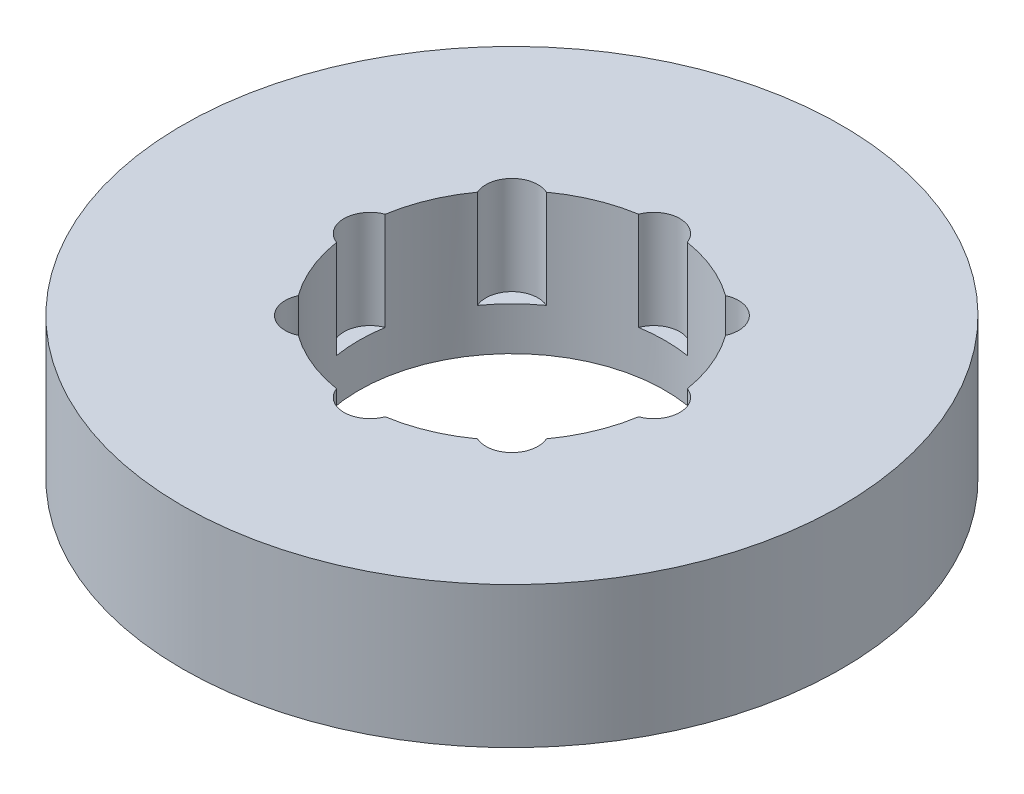
ISO-10303-21;
HEADER;
FILE_DESCRIPTION(('STEP AP214'),'2;1');
FILE_NAME('part.step','',(''),(''),'','','');
FILE_SCHEMA(('AUTOMOTIVE_DESIGN { 1 0 10303 214 1 1 1 1 }'));
ENDSEC;
DATA;
#1=APPLICATION_CONTEXT('core data for automotive mechanical design processes');
#2=APPLICATION_PROTOCOL_DEFINITION('international standard','automotive_design',2000,#1);
#3=PRODUCT_CONTEXT('',#1,'mechanical');
#4=PRODUCT('Part','Part','',(#3));
#5=PRODUCT_RELATED_PRODUCT_CATEGORY('part','',(#4));
#6=PRODUCT_DEFINITION_FORMATION('','',#4);
#7=PRODUCT_DEFINITION_CONTEXT('part definition',#1,'design');
#8=PRODUCT_DEFINITION('design','',#6,#7);
#9=PRODUCT_DEFINITION_SHAPE('','',#8);
#10=(LENGTH_UNIT() NAMED_UNIT(*) SI_UNIT(.MILLI.,.METRE.));
#11=(NAMED_UNIT(*) PLANE_ANGLE_UNIT() SI_UNIT($,.RADIAN.));
#12=(NAMED_UNIT(*) SI_UNIT($,.STERADIAN.) SOLID_ANGLE_UNIT());
#13=UNCERTAINTY_MEASURE_WITH_UNIT(LENGTH_MEASURE(1.E-05),#10,'distance_accuracy_value','');
#14=(GEOMETRIC_REPRESENTATION_CONTEXT(3) GLOBAL_UNCERTAINTY_ASSIGNED_CONTEXT((#13)) GLOBAL_UNIT_ASSIGNED_CONTEXT((#10,
#11,#12)) REPRESENTATION_CONTEXT('',''));
#15=CARTESIAN_POINT('',(0.,0.,0.));
#16=DIRECTION('',(0.,0.,1.));
#17=DIRECTION('',(1.,0.,0.));
#18=AXIS2_PLACEMENT_3D('',#15,#16,#17);
#19=CARTESIAN_POINT('',(0.,30.,0.));
#20=DIRECTION('',(0.,-1.,0.));
#21=DIRECTION('',(0.,0.,-1.));
#22=AXIS2_PLACEMENT_3D('',#19,#20,#21);
#23=CYLINDRICAL_SURFACE('',#22,70.);
#24=CARTESIAN_POINT('',(0.,30.,0.));
#25=DIRECTION('',(0.,1.,0.));
#26=DIRECTION('',(0.,0.,1.));
#27=AXIS2_PLACEMENT_3D('',#24,#25,#26);
#28=CIRCLE('',#27,70.);
#29=CARTESIAN_POINT('',(0.,30.,70.));
#30=VERTEX_POINT('',#29);
#31=EDGE_CURVE('E183',#30,#30,#28,.T.);
#32=ORIENTED_EDGE('',*,*,#31,.F.);
#33=EDGE_LOOP('',(#32));
#34=FACE_BOUND('',#33,.T.);
#35=CARTESIAN_POINT('',(0.,0.,0.));
#36=DIRECTION('',(0.,1.,0.));
#37=DIRECTION('',(0.,0.,1.));
#38=AXIS2_PLACEMENT_3D('',#35,#36,#37);
#39=CIRCLE('',#38,70.);
#40=CARTESIAN_POINT('',(0.,0.,70.));
#41=VERTEX_POINT('',#40);
#42=EDGE_CURVE('E182',#41,#41,#39,.T.);
#43=ORIENTED_EDGE('',*,*,#42,.T.);
#44=EDGE_LOOP('',(#43));
#45=FACE_BOUND('',#44,.T.);
#46=ADVANCED_FACE('F39',(#34,#45),#23,.T.);
#47=CARTESIAN_POINT('',(0.,30.,0.));
#48=DIRECTION('',(0.,1.,0.));
#49=DIRECTION('',(0.,0.,1.));
#50=AXIS2_PLACEMENT_3D('',#47,#48,#49);
#51=PLANE('',#50);
#52=CARTESIAN_POINT('',(1.05216337679654E-13,30.,30.1351568198605));
#53=DIRECTION('',(0.,1.,0.));
#54=DIRECTION('',(1.,0.,0.));
#55=AXIS2_PLACEMENT_3D('',#52,#53,#54);
#56=CIRCLE('',#55,5.52938833569611);
#57=CARTESIAN_POINT('',(-5.17399955720129,30.,32.0855065190201));
#58=VERTEX_POINT('',#57);
#59=CARTESIAN_POINT('',(5.17399955720152,30.,32.0855065190201));
#60=VERTEX_POINT('',#59);
#61=EDGE_CURVE('E256',#58,#60,#56,.T.);
#62=ORIENTED_EDGE('',*,*,#61,.F.);
#63=CARTESIAN_POINT('',(0.,30.,0.));
#64=DIRECTION('',(0.,1.,0.));
#65=DIRECTION('',(0.,0.,1.));
#66=AXIS2_PLACEMENT_3D('',#63,#64,#65);
#67=CIRCLE('',#66,32.5);
#68=CARTESIAN_POINT('',(-19.0293090646509,30.,26.3464494101576));
#69=VERTEX_POINT('',#68);
#70=EDGE_CURVE('E175',#69,#58,#67,.T.);
#71=ORIENTED_EDGE('',*,*,#70,.F.);
#72=CARTESIAN_POINT('',(-21.3087737394434,30.,21.3087737394434));
#73=DIRECTION('',(0.,1.,0.));
#74=DIRECTION('',(0.707106781186549,0.,0.707106781186546));
#75=AXIS2_PLACEMENT_3D('',#72,#73,#74);
#76=CIRCLE('',#75,5.52938833569611);
#77=CARTESIAN_POINT('',(-26.3464494101575,30.,19.029309064651));
#78=VERTEX_POINT('',#77);
#79=EDGE_CURVE('E152',#78,#69,#76,.T.);
#80=ORIENTED_EDGE('',*,*,#79,.F.);
#81=CARTESIAN_POINT('',(-32.0855065190201,30.,5.17399955720141));
#82=VERTEX_POINT('',#81);
#83=EDGE_CURVE('E168',#82,#78,#67,.T.);
#84=ORIENTED_EDGE('',*,*,#83,.F.);
#85=CARTESIAN_POINT('',(-30.1351568198605,30.,0.));
#86=DIRECTION('',(0.,1.,0.));
#87=DIRECTION('',(0.,0.,1.));
#88=AXIS2_PLACEMENT_3D('',#85,#86,#87);
#89=CIRCLE('',#88,5.52938833569611);
#90=CARTESIAN_POINT('',(-32.0855065190201,30.,-5.17399955720141));
#91=VERTEX_POINT('',#90);
#92=EDGE_CURVE('E205',#91,#82,#89,.T.);
#93=ORIENTED_EDGE('',*,*,#92,.F.);
#94=CARTESIAN_POINT('',(-26.3464494101578,30.,-19.0293090646506));
#95=VERTEX_POINT('',#94);
#96=EDGE_CURVE('E181',#95,#91,#67,.T.);
#97=ORIENTED_EDGE('',*,*,#96,.F.);
#98=CARTESIAN_POINT('',(-21.3087737394437,30.,-21.3087737394431));
#99=DIRECTION('',(0.,1.,0.));
#100=DIRECTION('',(-0.707106781186539,0.,0.707106781186556));
#101=AXIS2_PLACEMENT_3D('',#98,#99,#100);
#102=CIRCLE('',#101,5.52938833569611);
#103=CARTESIAN_POINT('',(-19.0293090646513,30.,-26.3464494101574));
#104=VERTEX_POINT('',#103);
#105=EDGE_CURVE('E453',#104,#95,#102,.T.);
#106=ORIENTED_EDGE('',*,*,#105,.F.);
#107=CARTESIAN_POINT('',(-5.17399955720174,30.,-32.08550651902));
#108=VERTEX_POINT('',#107);
#109=EDGE_CURVE('E189',#108,#104,#67,.T.);
#110=ORIENTED_EDGE('',*,*,#109,.F.);
#111=CARTESIAN_POINT('',(-3.15649013038963E-13,30.,-30.1351568198605));
#112=DIRECTION('',(0.,1.,0.));
#113=DIRECTION('',(-1.,0.,0.));
#114=AXIS2_PLACEMENT_3D('',#111,#112,#113);
#115=CIRCLE('',#114,5.52938833569611);
#116=CARTESIAN_POINT('',(5.17399955720107,30.,-32.0855065190201));
#117=VERTEX_POINT('',#116);
#118=EDGE_CURVE('E462',#117,#108,#115,.T.);
#119=ORIENTED_EDGE('',*,*,#118,.F.);
#120=CARTESIAN_POINT('',(19.0293090646507,30.,-26.3464494101577));
#121=VERTEX_POINT('',#120);
#122=EDGE_CURVE('E197',#121,#117,#67,.T.);
#123=ORIENTED_EDGE('',*,*,#122,.F.);
#124=CARTESIAN_POINT('',(21.3087737394432,30.,-21.3087737394436));
#125=DIRECTION('',(0.,1.,0.));
#126=DIRECTION('',(-0.707106781186554,0.,-0.707106781186541));
#127=AXIS2_PLACEMENT_3D('',#124,#125,#126);
#128=CIRCLE('',#127,5.52938833569611);
#129=CARTESIAN_POINT('',(26.3464494101574,30.,-19.0293090646512));
#130=VERTEX_POINT('',#129);
#131=EDGE_CURVE('E470',#130,#121,#128,.T.);
#132=ORIENTED_EDGE('',*,*,#131,.F.);
#133=CARTESIAN_POINT('',(32.0855065190201,30.,-5.17399955720141));
#134=VERTEX_POINT('',#133);
#135=EDGE_CURVE('E489',#134,#130,#67,.T.);
#136=ORIENTED_EDGE('',*,*,#135,.F.);
#137=CARTESIAN_POINT('',(30.1351568198605,30.,0.));
#138=DIRECTION('',(0.,1.,0.));
#139=DIRECTION('',(0.,0.,-1.));
#140=AXIS2_PLACEMENT_3D('',#137,#138,#139);
#141=CIRCLE('',#140,5.52938833569611);
#142=CARTESIAN_POINT('',(32.0855065190201,30.,5.17399955720141));
#143=VERTEX_POINT('',#142);
#144=EDGE_CURVE('E476',#143,#134,#141,.T.);
#145=ORIENTED_EDGE('',*,*,#144,.F.);
#146=CARTESIAN_POINT('',(26.3464494101577,30.,19.0293090646508));
#147=VERTEX_POINT('',#146);
#148=EDGE_CURVE('E491',#147,#143,#67,.T.);
#149=ORIENTED_EDGE('',*,*,#148,.F.);
#150=CARTESIAN_POINT('',(21.3087737394435,30.,21.3087737394433));
#151=DIRECTION('',(0.,1.,0.));
#152=DIRECTION('',(0.707106781186544,0.,-0.707106781186551));
#153=AXIS2_PLACEMENT_3D('',#150,#151,#152);
#154=CIRCLE('',#153,5.52938833569611);
#155=CARTESIAN_POINT('',(19.0293090646511,30.,26.3464494101575));
#156=VERTEX_POINT('',#155);
#157=EDGE_CURVE('E475',#156,#147,#154,.T.);
#158=ORIENTED_EDGE('',*,*,#157,.F.);
#159=EDGE_CURVE('E190',#60,#156,#67,.T.);
#160=ORIENTED_EDGE('',*,*,#159,.F.);
#161=EDGE_LOOP('',(#62,#71,#80,#84,#93,#97,#106,#110,#119,#123,#132,#136,#145,#149,#158,#160));
#162=FACE_BOUND('',#161,.T.);
#163=ORIENTED_EDGE('',*,*,#31,.T.);
#164=EDGE_LOOP('',(#163));
#165=FACE_BOUND('',#164,.T.);
#166=ADVANCED_FACE('F170',(#162,#165),#51,.T.);
#167=CARTESIAN_POINT('',(0.,0.,0.));
#168=DIRECTION('',(0.,1.,0.));
#169=DIRECTION('',(0.,0.,1.));
#170=AXIS2_PLACEMENT_3D('',#167,#168,#169);
#171=PLANE('',#170);
#172=CARTESIAN_POINT('',(0.,0.,0.));
#173=DIRECTION('',(0.,1.,0.));
#174=DIRECTION('',(0.,0.,1.));
#175=AXIS2_PLACEMENT_3D('',#172,#173,#174);
#176=CIRCLE('',#175,32.5);
#177=CARTESIAN_POINT('',(0.,0.,32.5));
#178=VERTEX_POINT('',#177);
#179=EDGE_CURVE('E191',#178,#178,#176,.T.);
#180=ORIENTED_EDGE('',*,*,#179,.T.);
#181=EDGE_LOOP('',(#180));
#182=FACE_BOUND('',#181,.T.);
#183=ORIENTED_EDGE('',*,*,#42,.F.);
#184=EDGE_LOOP('',(#183));
#185=FACE_BOUND('',#184,.T.);
#186=ADVANCED_FACE('F277',(#182,#185),#171,.F.);
#187=CARTESIAN_POINT('',(0.,30.,0.));
#188=DIRECTION('',(0.,-1.,0.));
#189=DIRECTION('',(0.,0.,-1.));
#190=AXIS2_PLACEMENT_3D('',#187,#188,#189);
#191=CYLINDRICAL_SURFACE('',#190,32.5);
#192=DIRECTION('',(0.,1.,0.));
#193=VECTOR('',#192,1.);
#194=CARTESIAN_POINT('',(-5.17399955720129,19.585064636626,32.0855065190201));
#195=LINE('',#194,#193);
#196=CARTESIAN_POINT('',(-5.17399955720129,9.17012927325192,32.0855065190201));
#197=VERTEX_POINT('',#196);
#198=EDGE_CURVE('E11',#197,#58,#195,.T.);
#199=ORIENTED_EDGE('',*,*,#198,.F.);
#200=CARTESIAN_POINT('',(0.,9.17012927325192,0.));
#201=DIRECTION('',(0.,1.,0.));
#202=DIRECTION('',(0.,0.,1.));
#203=AXIS2_PLACEMENT_3D('',#200,#201,#202);
#204=CIRCLE('',#203,32.5);
#205=CARTESIAN_POINT('',(5.17399955720152,9.17012927325192,32.0855065190201));
#206=VERTEX_POINT('',#205);
#207=EDGE_CURVE('E251',#197,#206,#204,.T.);
#208=ORIENTED_EDGE('',*,*,#207,.T.);
#209=DIRECTION('',(0.,1.,0.));
#210=VECTOR('',#209,1.);
#211=CARTESIAN_POINT('',(5.17399955720152,19.585064636626,32.0855065190201));
#212=LINE('',#211,#210);
#213=EDGE_CURVE('E46',#60,#206,#212,.F.);
#214=ORIENTED_EDGE('',*,*,#213,.F.);
#215=ORIENTED_EDGE('',*,*,#159,.T.);
#216=DIRECTION('',(0.,1.,0.));
#217=VECTOR('',#216,1.);
#218=CARTESIAN_POINT('',(19.0293090646511,19.585064636626,26.3464494101575));
#219=LINE('',#218,#217);
#220=CARTESIAN_POINT('',(19.0293090646511,9.17012927325192,26.3464494101575));
#221=VERTEX_POINT('',#220);
#222=EDGE_CURVE('E253',#221,#156,#219,.T.);
#223=ORIENTED_EDGE('',*,*,#222,.F.);
#224=CARTESIAN_POINT('',(0.,9.17012927325192,0.));
#225=DIRECTION('',(0.,1.,0.));
#226=DIRECTION('',(0.,0.,1.));
#227=AXIS2_PLACEMENT_3D('',#224,#225,#226);
#228=CIRCLE('',#227,32.5);
#229=CARTESIAN_POINT('',(26.3464494101577,9.17012927325192,19.0293090646508));
#230=VERTEX_POINT('',#229);
#231=EDGE_CURVE('E246',#221,#230,#228,.T.);
#232=ORIENTED_EDGE('',*,*,#231,.T.);
#233=DIRECTION('',(0.,1.,0.));
#234=VECTOR('',#233,1.);
#235=CARTESIAN_POINT('',(26.3464494101577,19.585064636626,19.0293090646508));
#236=LINE('',#235,#234);
#237=EDGE_CURVE('E248',#147,#230,#236,.F.);
#238=ORIENTED_EDGE('',*,*,#237,.F.);
#239=ORIENTED_EDGE('',*,*,#148,.T.);
#240=DIRECTION('',(0.,1.,0.));
#241=VECTOR('',#240,1.);
#242=CARTESIAN_POINT('',(32.0855065190201,19.585064636626,5.1739995572014));
#243=LINE('',#242,#241);
#244=CARTESIAN_POINT('',(32.0855065190201,9.17012927325192,5.17399955720141));
#245=VERTEX_POINT('',#244);
#246=EDGE_CURVE('E243',#245,#143,#243,.T.);
#247=ORIENTED_EDGE('',*,*,#246,.F.);
#248=CARTESIAN_POINT('',(0.,9.17012927325192,0.));
#249=DIRECTION('',(0.,1.,0.));
#250=DIRECTION('',(0.,0.,1.));
#251=AXIS2_PLACEMENT_3D('',#248,#249,#250);
#252=CIRCLE('',#251,32.5);
#253=CARTESIAN_POINT('',(32.0855065190201,9.17012927325192,-5.17399955720141));
#254=VERTEX_POINT('',#253);
#255=EDGE_CURVE('E236',#245,#254,#252,.T.);
#256=ORIENTED_EDGE('',*,*,#255,.T.);
#257=DIRECTION('',(0.,1.,0.));
#258=VECTOR('',#257,1.);
#259=CARTESIAN_POINT('',(32.0855065190201,19.585064636626,-5.1739995572014));
#260=LINE('',#259,#258);
#261=EDGE_CURVE('E241',#134,#254,#260,.F.);
#262=ORIENTED_EDGE('',*,*,#261,.F.);
#263=ORIENTED_EDGE('',*,*,#135,.T.);
#264=DIRECTION('',(0.,1.,0.));
#265=VECTOR('',#264,1.);
#266=CARTESIAN_POINT('',(26.3464494101574,19.585064636626,-19.0293090646512));
#267=LINE('',#266,#265);
#268=CARTESIAN_POINT('',(26.3464494101574,9.17012927325192,-19.0293090646512));
#269=VERTEX_POINT('',#268);
#270=EDGE_CURVE('E237',#269,#130,#267,.T.);
#271=ORIENTED_EDGE('',*,*,#270,.F.);
#272=CARTESIAN_POINT('',(0.,9.17012927325192,0.));
#273=DIRECTION('',(0.,1.,0.));
#274=DIRECTION('',(0.,0.,1.));
#275=AXIS2_PLACEMENT_3D('',#272,#273,#274);
#276=CIRCLE('',#275,32.5);
#277=CARTESIAN_POINT('',(19.0293090646507,9.17012927325192,-26.3464494101577));
#278=VERTEX_POINT('',#277);
#279=EDGE_CURVE('E229',#269,#278,#276,.T.);
#280=ORIENTED_EDGE('',*,*,#279,.T.);
#281=DIRECTION('',(0.,1.,0.));
#282=VECTOR('',#281,1.);
#283=CARTESIAN_POINT('',(19.0293090646507,19.585064636626,-26.3464494101577));
#284=LINE('',#283,#282);
#285=EDGE_CURVE('E232',#121,#278,#284,.F.);
#286=ORIENTED_EDGE('',*,*,#285,.F.);
#287=ORIENTED_EDGE('',*,*,#122,.T.);
#288=DIRECTION('',(0.,1.,0.));
#289=VECTOR('',#288,1.);
#290=CARTESIAN_POINT('',(5.17399955720107,19.585064636626,-32.0855065190201));
#291=LINE('',#290,#289);
#292=CARTESIAN_POINT('',(5.17399955720107,9.17012927325192,-32.0855065190201));
#293=VERTEX_POINT('',#292);
#294=EDGE_CURVE('E227',#293,#117,#291,.T.);
#295=ORIENTED_EDGE('',*,*,#294,.F.);
#296=CARTESIAN_POINT('',(0.,9.17012927325192,0.));
#297=DIRECTION('',(0.,1.,0.));
#298=DIRECTION('',(0.,0.,1.));
#299=AXIS2_PLACEMENT_3D('',#296,#297,#298);
#300=CIRCLE('',#299,32.5);
#301=CARTESIAN_POINT('',(-5.17399955720174,9.17012927325192,-32.08550651902));
#302=VERTEX_POINT('',#301);
#303=EDGE_CURVE('E225',#293,#302,#300,.T.);
#304=ORIENTED_EDGE('',*,*,#303,.T.);
#305=DIRECTION('',(0.,1.,0.));
#306=VECTOR('',#305,1.);
#307=CARTESIAN_POINT('',(-5.17399955720174,19.585064636626,-32.08550651902));
#308=LINE('',#307,#306);
#309=EDGE_CURVE('E223',#108,#302,#308,.F.);
#310=ORIENTED_EDGE('',*,*,#309,.F.);
#311=ORIENTED_EDGE('',*,*,#109,.T.);
#312=DIRECTION('',(0.,1.,0.));
#313=VECTOR('',#312,1.);
#314=CARTESIAN_POINT('',(-19.0293090646513,19.585064636626,-26.3464494101574));
#315=LINE('',#314,#313);
#316=CARTESIAN_POINT('',(-19.0293090646513,9.17012927325192,-26.3464494101574));
#317=VERTEX_POINT('',#316);
#318=EDGE_CURVE('E219',#317,#104,#315,.T.);
#319=ORIENTED_EDGE('',*,*,#318,.F.);
#320=CARTESIAN_POINT('',(0.,9.17012927325192,0.));
#321=DIRECTION('',(0.,1.,0.));
#322=DIRECTION('',(0.,0.,1.));
#323=AXIS2_PLACEMENT_3D('',#320,#321,#322);
#324=CIRCLE('',#323,32.5);
#325=CARTESIAN_POINT('',(-26.3464494101578,9.17012927325192,-19.0293090646506));
#326=VERTEX_POINT('',#325);
#327=EDGE_CURVE('E159',#317,#326,#324,.T.);
#328=ORIENTED_EDGE('',*,*,#327,.T.);
#329=DIRECTION('',(0.,1.,0.));
#330=VECTOR('',#329,1.);
#331=CARTESIAN_POINT('',(-26.3464494101578,19.585064636626,-19.0293090646507));
#332=LINE('',#331,#330);
#333=EDGE_CURVE('E220',#95,#326,#332,.F.);
#334=ORIENTED_EDGE('',*,*,#333,.F.);
#335=ORIENTED_EDGE('',*,*,#96,.T.);
#336=DIRECTION('',(0.,1.,0.));
#337=VECTOR('',#336,1.);
#338=CARTESIAN_POINT('',(-32.0855065190201,19.585064636626,-5.1739995572014));
#339=LINE('',#338,#337);
#340=CARTESIAN_POINT('',(-32.0855065190201,9.17012927325192,-5.17399955720141));
#341=VERTEX_POINT('',#340);
#342=EDGE_CURVE('E209',#341,#91,#339,.T.);
#343=ORIENTED_EDGE('',*,*,#342,.F.);
#344=CARTESIAN_POINT('',(0.,9.17012927325192,0.));
#345=DIRECTION('',(0.,1.,0.));
#346=DIRECTION('',(0.,0.,1.));
#347=AXIS2_PLACEMENT_3D('',#344,#345,#346);
#348=CIRCLE('',#347,32.5);
#349=CARTESIAN_POINT('',(-32.0855065190201,9.17012927325192,5.17399955720141));
#350=VERTEX_POINT('',#349);
#351=EDGE_CURVE('E206',#341,#350,#348,.T.);
#352=ORIENTED_EDGE('',*,*,#351,.T.);
#353=DIRECTION('',(0.,1.,0.));
#354=VECTOR('',#353,1.);
#355=CARTESIAN_POINT('',(-32.0855065190201,19.585064636626,5.1739995572014));
#356=LINE('',#355,#354);
#357=EDGE_CURVE('E179',#82,#350,#356,.F.);
#358=ORIENTED_EDGE('',*,*,#357,.F.);
#359=ORIENTED_EDGE('',*,*,#83,.T.);
#360=DIRECTION('',(0.,1.,0.));
#361=VECTOR('',#360,1.);
#362=CARTESIAN_POINT('',(-26.3464494101575,19.585064636626,19.029309064651));
#363=LINE('',#362,#361);
#364=CARTESIAN_POINT('',(-26.3464494101575,9.17012927325192,19.029309064651));
#365=VERTEX_POINT('',#364);
#366=EDGE_CURVE('E147',#365,#78,#363,.T.);
#367=ORIENTED_EDGE('',*,*,#366,.F.);
#368=CARTESIAN_POINT('',(0.,9.17012927325192,0.));
#369=DIRECTION('',(0.,1.,0.));
#370=DIRECTION('',(0.,0.,1.));
#371=AXIS2_PLACEMENT_3D('',#368,#369,#370);
#372=CIRCLE('',#371,32.5);
#373=CARTESIAN_POINT('',(-19.0293090646509,9.17012927325192,26.3464494101576));
#374=VERTEX_POINT('',#373);
#375=EDGE_CURVE('E215',#365,#374,#372,.T.);
#376=ORIENTED_EDGE('',*,*,#375,.T.);
#377=DIRECTION('',(0.,1.,0.));
#378=VECTOR('',#377,1.);
#379=CARTESIAN_POINT('',(-19.0293090646509,19.585064636626,26.3464494101576));
#380=LINE('',#379,#378);
#381=EDGE_CURVE('E161',#69,#374,#380,.F.);
#382=ORIENTED_EDGE('',*,*,#381,.F.);
#383=ORIENTED_EDGE('',*,*,#70,.T.);
#384=EDGE_LOOP('',(#199,#208,#214,#215,#223,#232,#238,#239,#247,#256,#262,#263,#271,#280,#286,
#287,#295,#304,#310,#311,#319,#328,#334,#335,#343,#352,#358,#359,#367,#376,#382,#383));
#385=FACE_BOUND('',#384,.T.);
#386=ORIENTED_EDGE('',*,*,#179,.F.);
#387=EDGE_LOOP('',(#386));
#388=FACE_BOUND('',#387,.T.);
#389=ADVANCED_FACE('F176',(#385,#388),#191,.F.);
#390=CARTESIAN_POINT('',(-30.1351568198605,9.17012927325192,0.));
#391=DIRECTION('',(0.,1.,0.));
#392=DIRECTION('',(0.,0.,1.));
#393=AXIS2_PLACEMENT_3D('',#390,#391,#392);
#394=CYLINDRICAL_SURFACE('',#393,5.52938833569611);
#395=ORIENTED_EDGE('',*,*,#342,.T.);
#396=ORIENTED_EDGE('',*,*,#92,.T.);
#397=ORIENTED_EDGE('',*,*,#357,.T.);
#398=CARTESIAN_POINT('',(-30.1351568198605,9.17012927325192,0.));
#399=DIRECTION('',(0.,1.,0.));
#400=DIRECTION('',(0.,0.,1.));
#401=AXIS2_PLACEMENT_3D('',#398,#399,#400);
#402=CIRCLE('',#401,5.52938833569611);
#403=EDGE_CURVE('E200',#341,#350,#402,.T.);
#404=ORIENTED_EDGE('',*,*,#403,.F.);
#405=EDGE_LOOP('',(#395,#396,#397,#404));
#406=FACE_BOUND('',#405,.T.);
#407=ADVANCED_FACE('F286',(#406),#394,.F.);
#408=CARTESIAN_POINT('',(-30.1351568198605,9.17012927325192,0.));
#409=DIRECTION('',(0.,1.,0.));
#410=DIRECTION('',(0.,0.,1.));
#411=AXIS2_PLACEMENT_3D('',#408,#409,#410);
#412=PLANE('',#411);
#413=ORIENTED_EDGE('',*,*,#403,.T.);
#414=ORIENTED_EDGE('',*,*,#351,.F.);
#415=EDGE_LOOP('',(#413,#414));
#416=FACE_BOUND('',#415,.T.);
#417=ADVANCED_FACE('F289',(#416),#412,.T.);
#418=CARTESIAN_POINT('',(-21.3087737394434,9.17012927325192,21.3087737394434));
#419=DIRECTION('',(0.,1.,0.));
#420=DIRECTION('',(0.,0.,1.));
#421=AXIS2_PLACEMENT_3D('',#418,#419,#420);
#422=CYLINDRICAL_SURFACE('',#421,5.52938833569611);
#423=ORIENTED_EDGE('',*,*,#366,.T.);
#424=ORIENTED_EDGE('',*,*,#79,.T.);
#425=ORIENTED_EDGE('',*,*,#381,.T.);
#426=CARTESIAN_POINT('',(-21.3087737394434,9.17012927325192,21.3087737394434));
#427=DIRECTION('',(0.,1.,0.));
#428=DIRECTION('',(0.707106781186549,0.,0.707106781186546));
#429=AXIS2_PLACEMENT_3D('',#426,#427,#428);
#430=CIRCLE('',#429,5.52938833569611);
#431=EDGE_CURVE('E156',#365,#374,#430,.T.);
#432=ORIENTED_EDGE('',*,*,#431,.F.);
#433=EDGE_LOOP('',(#423,#424,#425,#432));
#434=FACE_BOUND('',#433,.T.);
#435=ADVANCED_FACE('F155',(#434),#422,.F.);
#436=CARTESIAN_POINT('',(-21.3087737394434,9.17012927325192,21.3087737394434));
#437=DIRECTION('',(0.,1.,0.));
#438=DIRECTION('',(0.707106781186549,0.,0.707106781186546));
#439=AXIS2_PLACEMENT_3D('',#436,#437,#438);
#440=PLANE('',#439);
#441=ORIENTED_EDGE('',*,*,#431,.T.);
#442=ORIENTED_EDGE('',*,*,#375,.F.);
#443=EDGE_LOOP('',(#441,#442));
#444=FACE_BOUND('',#443,.T.);
#445=ADVANCED_FACE('F300',(#444),#440,.T.);
#446=CARTESIAN_POINT('',(-21.3087737394437,9.17012927325192,-21.3087737394431));
#447=DIRECTION('',(0.,1.,0.));
#448=DIRECTION('',(0.,0.,1.));
#449=AXIS2_PLACEMENT_3D('',#446,#447,#448);
#450=CYLINDRICAL_SURFACE('',#449,5.52938833569611);
#451=ORIENTED_EDGE('',*,*,#318,.T.);
#452=ORIENTED_EDGE('',*,*,#105,.T.);
#453=ORIENTED_EDGE('',*,*,#333,.T.);
#454=CARTESIAN_POINT('',(-21.3087737394437,9.17012927325192,-21.3087737394431));
#455=DIRECTION('',(0.,1.,0.));
#456=DIRECTION('',(-0.707106781186539,0.,0.707106781186556));
#457=AXIS2_PLACEMENT_3D('',#454,#455,#456);
#458=CIRCLE('',#457,5.52938833569611);
#459=EDGE_CURVE('E454',#317,#326,#458,.T.);
#460=ORIENTED_EDGE('',*,*,#459,.F.);
#461=EDGE_LOOP('',(#451,#452,#453,#460));
#462=FACE_BOUND('',#461,.T.);
#463=ADVANCED_FACE('F299',(#462),#450,.F.);
#464=CARTESIAN_POINT('',(-21.3087737394437,9.17012927325192,-21.3087737394431));
#465=DIRECTION('',(0.,1.,0.));
#466=DIRECTION('',(-0.707106781186539,0.,0.707106781186556));
#467=AXIS2_PLACEMENT_3D('',#464,#465,#466);
#468=PLANE('',#467);
#469=ORIENTED_EDGE('',*,*,#459,.T.);
#470=ORIENTED_EDGE('',*,*,#327,.F.);
#471=EDGE_LOOP('',(#469,#470));
#472=FACE_BOUND('',#471,.T.);
#473=ADVANCED_FACE('F379',(#472),#468,.T.);
#474=CARTESIAN_POINT('',(-3.15649013038963E-13,9.17012927325192,-30.1351568198605));
#475=DIRECTION('',(0.,1.,0.));
#476=DIRECTION('',(0.,0.,1.));
#477=AXIS2_PLACEMENT_3D('',#474,#475,#476);
#478=CYLINDRICAL_SURFACE('',#477,5.52938833569611);
#479=ORIENTED_EDGE('',*,*,#294,.T.);
#480=ORIENTED_EDGE('',*,*,#118,.T.);
#481=ORIENTED_EDGE('',*,*,#309,.T.);
#482=CARTESIAN_POINT('',(-3.15649013038963E-13,9.17012927325192,-30.1351568198605));
#483=DIRECTION('',(0.,1.,0.));
#484=DIRECTION('',(-1.,0.,0.));
#485=AXIS2_PLACEMENT_3D('',#482,#483,#484);
#486=CIRCLE('',#485,5.52938833569611);
#487=EDGE_CURVE('E465',#293,#302,#486,.T.);
#488=ORIENTED_EDGE('',*,*,#487,.F.);
#489=EDGE_LOOP('',(#479,#480,#481,#488));
#490=FACE_BOUND('',#489,.T.);
#491=ADVANCED_FACE('F371',(#490),#478,.F.);
#492=CARTESIAN_POINT('',(-3.15649013038963E-13,9.17012927325192,-30.1351568198605));
#493=DIRECTION('',(0.,1.,0.));
#494=DIRECTION('',(-1.,0.,0.));
#495=AXIS2_PLACEMENT_3D('',#492,#493,#494);
#496=PLANE('',#495);
#497=ORIENTED_EDGE('',*,*,#487,.T.);
#498=ORIENTED_EDGE('',*,*,#303,.F.);
#499=EDGE_LOOP('',(#497,#498));
#500=FACE_BOUND('',#499,.T.);
#501=ADVANCED_FACE('F308',(#500),#496,.T.);
#502=CARTESIAN_POINT('',(21.3087737394432,9.17012927325192,-21.3087737394436));
#503=DIRECTION('',(0.,1.,0.));
#504=DIRECTION('',(0.,0.,1.));
#505=AXIS2_PLACEMENT_3D('',#502,#503,#504);
#506=CYLINDRICAL_SURFACE('',#505,5.52938833569611);
#507=ORIENTED_EDGE('',*,*,#270,.T.);
#508=ORIENTED_EDGE('',*,*,#131,.T.);
#509=ORIENTED_EDGE('',*,*,#285,.T.);
#510=CARTESIAN_POINT('',(21.3087737394432,9.17012927325192,-21.3087737394436));
#511=DIRECTION('',(0.,1.,0.));
#512=DIRECTION('',(-0.707106781186554,0.,-0.707106781186541));
#513=AXIS2_PLACEMENT_3D('',#510,#511,#512);
#514=CIRCLE('',#513,5.52938833569611);
#515=EDGE_CURVE('E477',#269,#278,#514,.T.);
#516=ORIENTED_EDGE('',*,*,#515,.F.);
#517=EDGE_LOOP('',(#507,#508,#509,#516));
#518=FACE_BOUND('',#517,.T.);
#519=ADVANCED_FACE('F305',(#518),#506,.F.);
#520=CARTESIAN_POINT('',(21.3087737394432,9.17012927325192,-21.3087737394436));
#521=DIRECTION('',(0.,1.,0.));
#522=DIRECTION('',(-0.707106781186554,0.,-0.707106781186541));
#523=AXIS2_PLACEMENT_3D('',#520,#521,#522);
#524=PLANE('',#523);
#525=ORIENTED_EDGE('',*,*,#515,.T.);
#526=ORIENTED_EDGE('',*,*,#279,.F.);
#527=EDGE_LOOP('',(#525,#526));
#528=FACE_BOUND('',#527,.T.);
#529=ADVANCED_FACE('F304',(#528),#524,.T.);
#530=CARTESIAN_POINT('',(30.1351568198605,9.17012927325192,0.));
#531=DIRECTION('',(0.,1.,0.));
#532=DIRECTION('',(0.,0.,1.));
#533=AXIS2_PLACEMENT_3D('',#530,#531,#532);
#534=CYLINDRICAL_SURFACE('',#533,5.52938833569611);
#535=ORIENTED_EDGE('',*,*,#246,.T.);
#536=ORIENTED_EDGE('',*,*,#144,.T.);
#537=ORIENTED_EDGE('',*,*,#261,.T.);
#538=CARTESIAN_POINT('',(30.1351568198605,9.17012927325192,0.));
#539=DIRECTION('',(0.,1.,0.));
#540=DIRECTION('',(0.,0.,-1.));
#541=AXIS2_PLACEMENT_3D('',#538,#539,#540);
#542=CIRCLE('',#541,5.52938833569611);
#543=EDGE_CURVE('E478',#245,#254,#542,.T.);
#544=ORIENTED_EDGE('',*,*,#543,.F.);
#545=EDGE_LOOP('',(#535,#536,#537,#544));
#546=FACE_BOUND('',#545,.T.);
#547=ADVANCED_FACE('F309',(#546),#534,.F.);
#548=CARTESIAN_POINT('',(30.1351568198605,9.17012927325192,0.));
#549=DIRECTION('',(0.,1.,0.));
#550=DIRECTION('',(0.,0.,-1.));
#551=AXIS2_PLACEMENT_3D('',#548,#549,#550);
#552=PLANE('',#551);
#553=ORIENTED_EDGE('',*,*,#543,.T.);
#554=ORIENTED_EDGE('',*,*,#255,.F.);
#555=EDGE_LOOP('',(#553,#554));
#556=FACE_BOUND('',#555,.T.);
#557=ADVANCED_FACE('F314',(#556),#552,.T.);
#558=CARTESIAN_POINT('',(21.3087737394435,9.17012927325192,21.3087737394433));
#559=DIRECTION('',(0.,1.,0.));
#560=DIRECTION('',(0.,0.,1.));
#561=AXIS2_PLACEMENT_3D('',#558,#559,#560);
#562=CYLINDRICAL_SURFACE('',#561,5.52938833569611);
#563=ORIENTED_EDGE('',*,*,#222,.T.);
#564=ORIENTED_EDGE('',*,*,#157,.T.);
#565=ORIENTED_EDGE('',*,*,#237,.T.);
#566=CARTESIAN_POINT('',(21.3087737394435,9.17012927325192,21.3087737394433));
#567=DIRECTION('',(0.,1.,0.));
#568=DIRECTION('',(0.707106781186544,0.,-0.707106781186551));
#569=AXIS2_PLACEMENT_3D('',#566,#567,#568);
#570=CIRCLE('',#569,5.52938833569611);
#571=EDGE_CURVE('E56',#221,#230,#570,.T.);
#572=ORIENTED_EDGE('',*,*,#571,.F.);
#573=EDGE_LOOP('',(#563,#564,#565,#572));
#574=FACE_BOUND('',#573,.T.);
#575=ADVANCED_FACE('F318',(#574),#562,.F.);
#576=CARTESIAN_POINT('',(21.3087737394435,9.17012927325192,21.3087737394433));
#577=DIRECTION('',(0.,1.,0.));
#578=DIRECTION('',(0.707106781186544,0.,-0.707106781186551));
#579=AXIS2_PLACEMENT_3D('',#576,#577,#578);
#580=PLANE('',#579);
#581=ORIENTED_EDGE('',*,*,#571,.T.);
#582=ORIENTED_EDGE('',*,*,#231,.F.);
#583=EDGE_LOOP('',(#581,#582));
#584=FACE_BOUND('',#583,.T.);
#585=ADVANCED_FACE('F270',(#584),#580,.T.);
#586=CARTESIAN_POINT('',(1.05216337679654E-13,9.17012927325192,30.1351568198605));
#587=DIRECTION('',(0.,1.,0.));
#588=DIRECTION('',(0.,0.,1.));
#589=AXIS2_PLACEMENT_3D('',#586,#587,#588);
#590=CYLINDRICAL_SURFACE('',#589,5.52938833569611);
#591=ORIENTED_EDGE('',*,*,#198,.T.);
#592=ORIENTED_EDGE('',*,*,#61,.T.);
#593=ORIENTED_EDGE('',*,*,#213,.T.);
#594=CARTESIAN_POINT('',(1.05216337679654E-13,9.17012927325192,30.1351568198605));
#595=DIRECTION('',(0.,1.,0.));
#596=DIRECTION('',(1.,0.,0.));
#597=AXIS2_PLACEMENT_3D('',#594,#595,#596);
#598=CIRCLE('',#597,5.52938833569611);
#599=EDGE_CURVE('E55',#197,#206,#598,.T.);
#600=ORIENTED_EDGE('',*,*,#599,.F.);
#601=EDGE_LOOP('',(#591,#592,#593,#600));
#602=FACE_BOUND('',#601,.T.);
#603=ADVANCED_FACE('F260',(#602),#590,.F.);
#604=CARTESIAN_POINT('',(1.05216337679654E-13,9.17012927325192,30.1351568198605));
#605=DIRECTION('',(0.,1.,0.));
#606=DIRECTION('',(1.,0.,0.));
#607=AXIS2_PLACEMENT_3D('',#604,#605,#606);
#608=PLANE('',#607);
#609=ORIENTED_EDGE('',*,*,#599,.T.);
#610=ORIENTED_EDGE('',*,*,#207,.F.);
#611=EDGE_LOOP('',(#609,#610));
#612=FACE_BOUND('',#611,.T.);
#613=ADVANCED_FACE('F261',(#612),#608,.T.);
#614=CLOSED_SHELL('',(#46,#166,#186,#389,#407,#417,#435,#445,#463,#473,#491,#501,#519,#529,#547,
#557,#575,#585,#603,#613));
#615=MANIFOLD_SOLID_BREP('B2',#614);
#616=ADVANCED_BREP_SHAPE_REPRESENTATION('',(#18,#615),#14);
#617=SHAPE_DEFINITION_REPRESENTATION(#9,#616);
ENDSEC;
END-ISO-10303-21;
